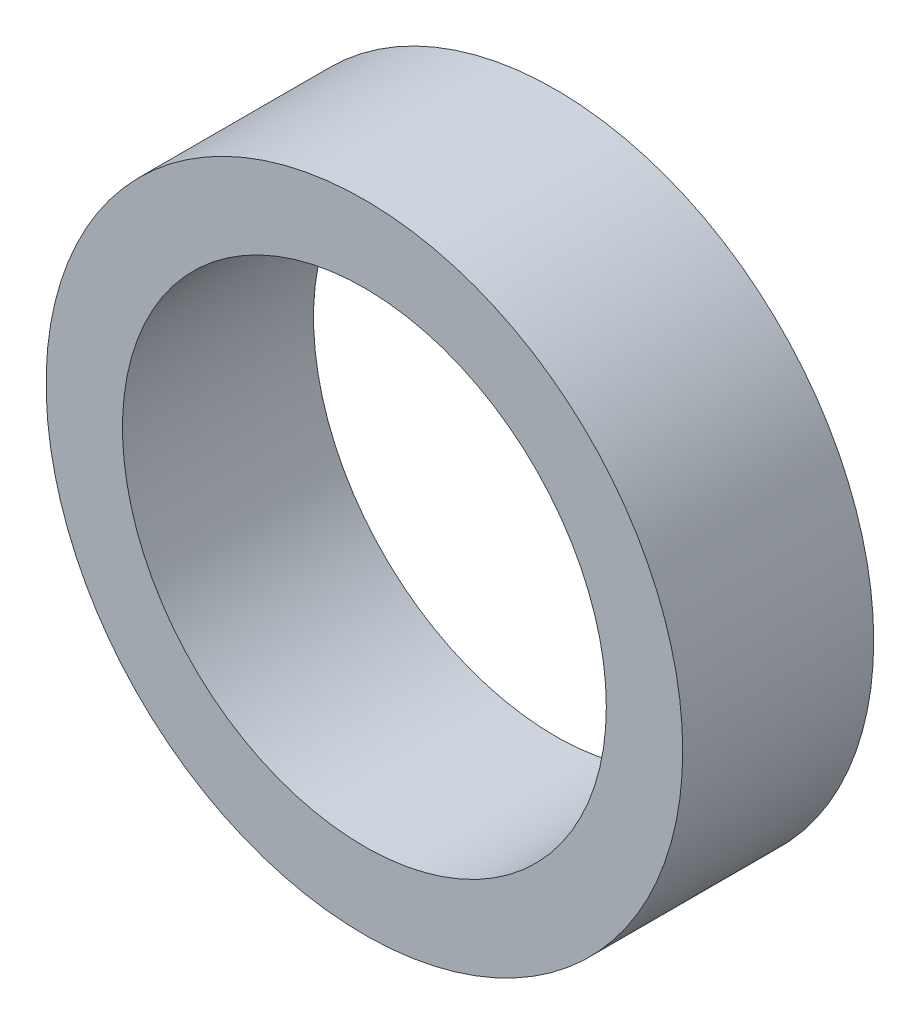
ISO-10303-21;
HEADER;
FILE_DESCRIPTION(('STEP AP214'),'2;1');
FILE_NAME('part.step','',(''),(''),'','','');
FILE_SCHEMA(('AUTOMOTIVE_DESIGN { 1 0 10303 214 1 1 1 1 }'));
ENDSEC;
DATA;
#1=APPLICATION_CONTEXT('core data for automotive mechanical design processes');
#2=APPLICATION_PROTOCOL_DEFINITION('international standard','automotive_design',2000,#1);
#3=PRODUCT_CONTEXT('',#1,'mechanical');
#4=PRODUCT('Part','Part','',(#3));
#5=PRODUCT_RELATED_PRODUCT_CATEGORY('part','',(#4));
#6=PRODUCT_DEFINITION_FORMATION('','',#4);
#7=PRODUCT_DEFINITION_CONTEXT('part definition',#1,'design');
#8=PRODUCT_DEFINITION('design','',#6,#7);
#9=PRODUCT_DEFINITION_SHAPE('','',#8);
#10=(LENGTH_UNIT() NAMED_UNIT(*) SI_UNIT(.MILLI.,.METRE.));
#11=(NAMED_UNIT(*) PLANE_ANGLE_UNIT() SI_UNIT($,.RADIAN.));
#12=(NAMED_UNIT(*) SI_UNIT($,.STERADIAN.) SOLID_ANGLE_UNIT());
#13=UNCERTAINTY_MEASURE_WITH_UNIT(LENGTH_MEASURE(1.E-05),#10,'distance_accuracy_value','');
#14=(GEOMETRIC_REPRESENTATION_CONTEXT(3) GLOBAL_UNCERTAINTY_ASSIGNED_CONTEXT((#13)) GLOBAL_UNIT_ASSIGNED_CONTEXT((#10,
#11,#12)) REPRESENTATION_CONTEXT('',''));
#15=CARTESIAN_POINT('',(0.,0.,0.));
#16=DIRECTION('',(0.,0.,1.));
#17=DIRECTION('',(1.,0.,0.));
#18=AXIS2_PLACEMENT_3D('',#15,#16,#17);
#19=CARTESIAN_POINT('',(0.,0.,6.));
#20=DIRECTION('',(0.,0.,1.));
#21=DIRECTION('',(1.,0.,0.));
#22=AXIS2_PLACEMENT_3D('',#19,#20,#21);
#23=PLANE('',#22);
#24=CARTESIAN_POINT('',(0.,0.,6.));
#25=DIRECTION('',(0.,0.,1.));
#26=DIRECTION('',(1.,0.,0.));
#27=AXIS2_PLACEMENT_3D('',#24,#25,#26);
#28=CIRCLE('',#27,10.);
#29=CARTESIAN_POINT('',(10.,0.,6.));
#30=VERTEX_POINT('',#29);
#31=EDGE_CURVE('E10',#30,#30,#28,.T.);
#32=ORIENTED_EDGE('',*,*,#31,.T.);
#33=EDGE_LOOP('',(#32));
#34=FACE_BOUND('',#33,.T.);
#35=CARTESIAN_POINT('',(0.,0.,6.));
#36=DIRECTION('',(0.,0.,1.));
#37=DIRECTION('',(1.,0.,0.));
#38=AXIS2_PLACEMENT_3D('',#35,#36,#37);
#39=CIRCLE('',#38,7.6);
#40=CARTESIAN_POINT('',(7.6,0.,6.));
#41=VERTEX_POINT('',#40);
#42=EDGE_CURVE('E43',#41,#41,#39,.T.);
#43=ORIENTED_EDGE('',*,*,#42,.F.);
#44=EDGE_LOOP('',(#43));
#45=FACE_BOUND('',#44,.T.);
#46=ADVANCED_FACE('F32',(#34,#45),#23,.T.);
#47=CARTESIAN_POINT('',(0.,0.,0.));
#48=DIRECTION('',(0.,0.,1.));
#49=DIRECTION('',(1.,0.,0.));
#50=AXIS2_PLACEMENT_3D('',#47,#48,#49);
#51=PLANE('',#50);
#52=CARTESIAN_POINT('',(0.,0.,0.));
#53=DIRECTION('',(0.,0.,1.));
#54=DIRECTION('',(1.,0.,0.));
#55=AXIS2_PLACEMENT_3D('',#52,#53,#54);
#56=CIRCLE('',#55,10.);
#57=CARTESIAN_POINT('',(10.,0.,0.));
#58=VERTEX_POINT('',#57);
#59=EDGE_CURVE('E36',#58,#58,#56,.T.);
#60=ORIENTED_EDGE('',*,*,#59,.F.);
#61=EDGE_LOOP('',(#60));
#62=FACE_BOUND('',#61,.T.);
#63=CARTESIAN_POINT('',(0.,0.,0.));
#64=DIRECTION('',(0.,0.,1.));
#65=DIRECTION('',(1.,0.,0.));
#66=AXIS2_PLACEMENT_3D('',#63,#64,#65);
#67=CIRCLE('',#66,7.6);
#68=CARTESIAN_POINT('',(7.6,0.,0.));
#69=VERTEX_POINT('',#68);
#70=EDGE_CURVE('E45',#69,#69,#67,.T.);
#71=ORIENTED_EDGE('',*,*,#70,.T.);
#72=EDGE_LOOP('',(#71));
#73=FACE_BOUND('',#72,.T.);
#74=ADVANCED_FACE('F55',(#62,#73),#51,.F.);
#75=CARTESIAN_POINT('',(0.,0.,6.));
#76=DIRECTION('',(0.,0.,-1.));
#77=DIRECTION('',(-1.,0.,0.));
#78=AXIS2_PLACEMENT_3D('',#75,#76,#77);
#79=CYLINDRICAL_SURFACE('',#78,10.);
#80=ORIENTED_EDGE('',*,*,#31,.F.);
#81=EDGE_LOOP('',(#80));
#82=FACE_BOUND('',#81,.T.);
#83=ORIENTED_EDGE('',*,*,#59,.T.);
#84=EDGE_LOOP('',(#83));
#85=FACE_BOUND('',#84,.T.);
#86=ADVANCED_FACE('F34',(#82,#85),#79,.T.);
#87=CARTESIAN_POINT('',(0.,0.,6.));
#88=DIRECTION('',(0.,0.,-1.));
#89=DIRECTION('',(-1.,0.,0.));
#90=AXIS2_PLACEMENT_3D('',#87,#88,#89);
#91=CYLINDRICAL_SURFACE('',#90,7.6);
#92=ORIENTED_EDGE('',*,*,#42,.T.);
#93=EDGE_LOOP('',(#92));
#94=FACE_BOUND('',#93,.T.);
#95=ORIENTED_EDGE('',*,*,#70,.F.);
#96=EDGE_LOOP('',(#95));
#97=FACE_BOUND('',#96,.T.);
#98=ADVANCED_FACE('F51',(#94,#97),#91,.F.);
#99=CLOSED_SHELL('',(#46,#74,#86,#98));
#100=MANIFOLD_SOLID_BREP('B2',#99);
#101=ADVANCED_BREP_SHAPE_REPRESENTATION('',(#18,#100),#14);
#102=SHAPE_DEFINITION_REPRESENTATION(#9,#101);
ENDSEC;
END-ISO-10303-21;
